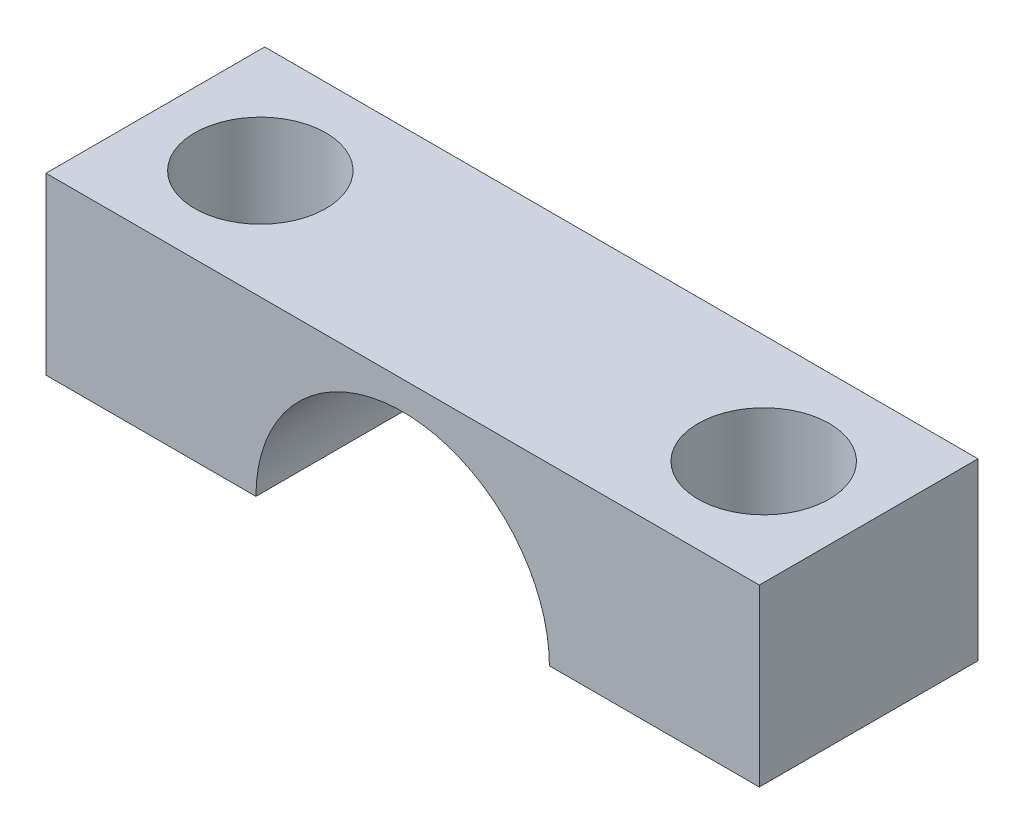
ISO-10303-21;
HEADER;
FILE_DESCRIPTION(('STEP AP214'),'2;1');
FILE_NAME('part.step','',(''),(''),'','','');
FILE_SCHEMA(('AUTOMOTIVE_DESIGN { 1 0 10303 214 1 1 1 1 }'));
ENDSEC;
DATA;
#1=APPLICATION_CONTEXT('core data for automotive mechanical design processes');
#2=APPLICATION_PROTOCOL_DEFINITION('international standard','automotive_design',2000,#1);
#3=PRODUCT_CONTEXT('',#1,'mechanical');
#4=PRODUCT('Part','Part','',(#3));
#5=PRODUCT_RELATED_PRODUCT_CATEGORY('part','',(#4));
#6=PRODUCT_DEFINITION_FORMATION('','',#4);
#7=PRODUCT_DEFINITION_CONTEXT('part definition',#1,'design');
#8=PRODUCT_DEFINITION('design','',#6,#7);
#9=PRODUCT_DEFINITION_SHAPE('','',#8);
#10=(LENGTH_UNIT() NAMED_UNIT(*) SI_UNIT(.MILLI.,.METRE.));
#11=(NAMED_UNIT(*) PLANE_ANGLE_UNIT() SI_UNIT($,.RADIAN.));
#12=(NAMED_UNIT(*) SI_UNIT($,.STERADIAN.) SOLID_ANGLE_UNIT());
#13=UNCERTAINTY_MEASURE_WITH_UNIT(LENGTH_MEASURE(1.E-05),#10,'distance_accuracy_value','');
#14=(GEOMETRIC_REPRESENTATION_CONTEXT(3) GLOBAL_UNCERTAINTY_ASSIGNED_CONTEXT((#13)) GLOBAL_UNIT_ASSIGNED_CONTEXT((#10,
#11,#12)) REPRESENTATION_CONTEXT('',''));
#15=CARTESIAN_POINT('',(0.,0.,0.));
#16=DIRECTION('',(0.,0.,1.));
#17=DIRECTION('',(1.,0.,0.));
#18=AXIS2_PLACEMENT_3D('',#15,#16,#17);
#19=CARTESIAN_POINT('',(-8.155,-2.,-5.));
#20=DIRECTION('',(0.,-1.,0.));
#21=DIRECTION('',(0.,0.,-1.));
#22=AXIS2_PLACEMENT_3D('',#19,#20,#21);
#23=PLANE('',#22);
#24=CARTESIAN_POINT('',(5.755,-2.,-2.5));
#25=DIRECTION('',(0.,-1.,0.));
#26=DIRECTION('',(0.,0.,-1.));
#27=AXIS2_PLACEMENT_3D('',#24,#25,#26);
#28=CIRCLE('',#27,1.5);
#29=CARTESIAN_POINT('',(5.755,-2.,-4.));
#30=VERTEX_POINT('',#29);
#31=EDGE_CURVE('E138',#30,#30,#28,.F.);
#32=ORIENTED_EDGE('',*,*,#31,.T.);
#33=EDGE_LOOP('',(#32));
#34=FACE_BOUND('',#33,.T.);
#35=DIRECTION('',(0.,0.,1.));
#36=VECTOR('',#35,1.);
#37=CARTESIAN_POINT('',(3.355,-2.,-5.));
#38=LINE('',#37,#36);
#39=CARTESIAN_POINT('',(3.355,-2.,-5.));
#40=VERTEX_POINT('',#39);
#41=CARTESIAN_POINT('',(3.355,-2.,0.));
#42=VERTEX_POINT('',#41);
#43=EDGE_CURVE('E55',#40,#42,#38,.T.);
#44=ORIENTED_EDGE('',*,*,#43,.F.);
#45=DIRECTION('',(1.,0.,0.));
#46=VECTOR('',#45,1.);
#47=CARTESIAN_POINT('',(-8.155,-2.,-5.));
#48=LINE('',#47,#46);
#49=CARTESIAN_POINT('',(8.155,-2.,-5.));
#50=VERTEX_POINT('',#49);
#51=EDGE_CURVE('E87',#40,#50,#48,.T.);
#52=ORIENTED_EDGE('',*,*,#51,.T.);
#53=DIRECTION('',(0.,0.,1.));
#54=VECTOR('',#53,1.);
#55=CARTESIAN_POINT('',(8.155,-2.,-5.));
#56=LINE('',#55,#54);
#57=CARTESIAN_POINT('',(8.155,-2.,0.));
#58=VERTEX_POINT('',#57);
#59=EDGE_CURVE('E121',#50,#58,#56,.T.);
#60=ORIENTED_EDGE('',*,*,#59,.T.);
#61=DIRECTION('',(1.,0.,0.));
#62=VECTOR('',#61,1.);
#63=CARTESIAN_POINT('',(-8.155,-2.,0.));
#64=LINE('',#63,#62);
#65=EDGE_CURVE('E125',#42,#58,#64,.T.);
#66=ORIENTED_EDGE('',*,*,#65,.F.);
#67=EDGE_LOOP('',(#44,#52,#60,#66));
#68=FACE_BOUND('',#67,.T.);
#69=ADVANCED_FACE('F38',(#34,#68),#23,.T.);
#70=CARTESIAN_POINT('',(-5.755,-2.,-2.5));
#71=DIRECTION('',(0.,-1.,0.));
#72=DIRECTION('',(0.,0.,-1.));
#73=AXIS2_PLACEMENT_3D('',#70,#71,#72);
#74=CIRCLE('',#73,1.5);
#75=CARTESIAN_POINT('',(-5.755,-2.,-4.));
#76=VERTEX_POINT('',#75);
#77=EDGE_CURVE('E146',#76,#76,#74,.F.);
#78=ORIENTED_EDGE('',*,*,#77,.T.);
#79=EDGE_LOOP('',(#78));
#80=FACE_BOUND('',#79,.T.);
#81=DIRECTION('',(0.,0.,1.));
#82=VECTOR('',#81,1.);
#83=CARTESIAN_POINT('',(-3.355,-2.,-5.));
#84=LINE('',#83,#82);
#85=CARTESIAN_POINT('',(-3.355,-2.,-5.));
#86=VERTEX_POINT('',#85);
#87=CARTESIAN_POINT('',(-3.355,-2.,0.));
#88=VERTEX_POINT('',#87);
#89=EDGE_CURVE('E97',#86,#88,#84,.T.);
#90=ORIENTED_EDGE('',*,*,#89,.T.);
#91=CARTESIAN_POINT('',(-8.155,-2.,0.));
#92=VERTEX_POINT('',#91);
#93=EDGE_CURVE('E122',#92,#88,#64,.T.);
#94=ORIENTED_EDGE('',*,*,#93,.F.);
#95=DIRECTION('',(0.,0.,1.));
#96=VECTOR('',#95,1.);
#97=CARTESIAN_POINT('',(-8.155,-2.,-5.));
#98=LINE('',#97,#96);
#99=CARTESIAN_POINT('',(-8.155,-2.,-5.));
#100=VERTEX_POINT('',#99);
#101=EDGE_CURVE('E11',#100,#92,#98,.T.);
#102=ORIENTED_EDGE('',*,*,#101,.F.);
#103=EDGE_CURVE('E107',#100,#86,#48,.T.);
#104=ORIENTED_EDGE('',*,*,#103,.T.);
#105=EDGE_LOOP('',(#90,#94,#102,#104));
#106=FACE_BOUND('',#105,.T.);
#107=ADVANCED_FACE('F40',(#80,#106),#23,.T.);
#108=CARTESIAN_POINT('',(-8.155,-2.,-5.));
#109=DIRECTION('',(1.,0.,0.));
#110=DIRECTION('',(0.,0.,-1.));
#111=AXIS2_PLACEMENT_3D('',#108,#109,#110);
#112=PLANE('',#111);
#113=DIRECTION('',(0.,1.,0.));
#114=VECTOR('',#113,1.);
#115=CARTESIAN_POINT('',(-8.155,-2.,0.));
#116=LINE('',#115,#114);
#117=CARTESIAN_POINT('',(-8.155,2.,0.));
#118=VERTEX_POINT('',#117);
#119=EDGE_CURVE('E115',#92,#118,#116,.T.);
#120=ORIENTED_EDGE('',*,*,#119,.T.);
#121=DIRECTION('',(0.,0.,1.));
#122=VECTOR('',#121,1.);
#123=CARTESIAN_POINT('',(-8.155,2.,-5.));
#124=LINE('',#123,#122);
#125=CARTESIAN_POINT('',(-8.155,2.,-5.));
#126=VERTEX_POINT('',#125);
#127=EDGE_CURVE('E47',#126,#118,#124,.T.);
#128=ORIENTED_EDGE('',*,*,#127,.F.);
#129=DIRECTION('',(0.,1.,0.));
#130=VECTOR('',#129,1.);
#131=CARTESIAN_POINT('',(-8.155,-2.,-5.));
#132=LINE('',#131,#130);
#133=EDGE_CURVE('E119',#100,#126,#132,.T.);
#134=ORIENTED_EDGE('',*,*,#133,.F.);
#135=ORIENTED_EDGE('',*,*,#101,.T.);
#136=EDGE_LOOP('',(#120,#128,#134,#135));
#137=FACE_BOUND('',#136,.T.);
#138=ADVANCED_FACE('F162',(#137),#112,.F.);
#139=CARTESIAN_POINT('',(-8.155,2.,-5.));
#140=DIRECTION('',(0.,-1.,0.));
#141=DIRECTION('',(0.,0.,-1.));
#142=AXIS2_PLACEMENT_3D('',#139,#140,#141);
#143=PLANE('',#142);
#144=CARTESIAN_POINT('',(-5.755,2.,-2.5));
#145=DIRECTION('',(0.,-1.,0.));
#146=DIRECTION('',(0.,0.,-1.));
#147=AXIS2_PLACEMENT_3D('',#144,#145,#146);
#148=CIRCLE('',#147,1.5);
#149=CARTESIAN_POINT('',(-5.755,2.,-4.));
#150=VERTEX_POINT('',#149);
#151=EDGE_CURVE('E42',#150,#150,#148,.F.);
#152=ORIENTED_EDGE('',*,*,#151,.F.);
#153=EDGE_LOOP('',(#152));
#154=FACE_BOUND('',#153,.T.);
#155=CARTESIAN_POINT('',(5.755,2.,-2.5));
#156=DIRECTION('',(0.,-1.,0.));
#157=DIRECTION('',(0.,0.,-1.));
#158=AXIS2_PLACEMENT_3D('',#155,#156,#157);
#159=CIRCLE('',#158,1.5);
#160=CARTESIAN_POINT('',(5.755,2.,-4.));
#161=VERTEX_POINT('',#160);
#162=EDGE_CURVE('E136',#161,#161,#159,.F.);
#163=ORIENTED_EDGE('',*,*,#162,.F.);
#164=EDGE_LOOP('',(#163));
#165=FACE_BOUND('',#164,.T.);
#166=DIRECTION('',(1.,0.,0.));
#167=VECTOR('',#166,1.);
#168=CARTESIAN_POINT('',(-8.155,2.,0.));
#169=LINE('',#168,#167);
#170=CARTESIAN_POINT('',(8.155,2.,0.));
#171=VERTEX_POINT('',#170);
#172=EDGE_CURVE('E128',#118,#171,#169,.T.);
#173=ORIENTED_EDGE('',*,*,#172,.T.);
#174=DIRECTION('',(0.,0.,1.));
#175=VECTOR('',#174,1.);
#176=CARTESIAN_POINT('',(8.155,2.,-5.));
#177=LINE('',#176,#175);
#178=CARTESIAN_POINT('',(8.155,2.,-5.));
#179=VERTEX_POINT('',#178);
#180=EDGE_CURVE('E134',#179,#171,#177,.T.);
#181=ORIENTED_EDGE('',*,*,#180,.F.);
#182=DIRECTION('',(1.,0.,0.));
#183=VECTOR('',#182,1.);
#184=CARTESIAN_POINT('',(-8.155,2.,-5.));
#185=LINE('',#184,#183);
#186=EDGE_CURVE('E113',#126,#179,#185,.T.);
#187=ORIENTED_EDGE('',*,*,#186,.F.);
#188=ORIENTED_EDGE('',*,*,#127,.T.);
#189=EDGE_LOOP('',(#173,#181,#187,#188));
#190=FACE_BOUND('',#189,.T.);
#191=ADVANCED_FACE('F160',(#154,#165,#190),#143,.F.);
#192=CARTESIAN_POINT('',(8.155,-2.,-5.));
#193=DIRECTION('',(1.,0.,0.));
#194=DIRECTION('',(0.,0.,-1.));
#195=AXIS2_PLACEMENT_3D('',#192,#193,#194);
#196=PLANE('',#195);
#197=DIRECTION('',(0.,1.,0.));
#198=VECTOR('',#197,1.);
#199=CARTESIAN_POINT('',(8.155,-2.,0.));
#200=LINE('',#199,#198);
#201=EDGE_CURVE('E124',#58,#171,#200,.T.);
#202=ORIENTED_EDGE('',*,*,#201,.F.);
#203=ORIENTED_EDGE('',*,*,#59,.F.);
#204=DIRECTION('',(0.,1.,0.));
#205=VECTOR('',#204,1.);
#206=CARTESIAN_POINT('',(8.155,-2.,-5.));
#207=LINE('',#206,#205);
#208=EDGE_CURVE('E110',#50,#179,#207,.T.);
#209=ORIENTED_EDGE('',*,*,#208,.T.);
#210=ORIENTED_EDGE('',*,*,#180,.T.);
#211=EDGE_LOOP('',(#202,#203,#209,#210));
#212=FACE_BOUND('',#211,.T.);
#213=ADVANCED_FACE('F156',(#212),#196,.T.);
#214=CARTESIAN_POINT('',(0.,0.,-5.));
#215=DIRECTION('',(0.,0.,1.));
#216=DIRECTION('',(1.,0.,0.));
#217=AXIS2_PLACEMENT_3D('',#214,#215,#216);
#218=PLANE('',#217);
#219=ORIENTED_EDGE('',*,*,#51,.F.);
#220=CARTESIAN_POINT('',(0.,-2.,-5.));
#221=DIRECTION('',(0.,0.,1.));
#222=DIRECTION('',(1.,0.,0.));
#223=AXIS2_PLACEMENT_3D('',#220,#221,#222);
#224=CIRCLE('',#223,3.355);
#225=EDGE_CURVE('E100',#40,#86,#224,.T.);
#226=ORIENTED_EDGE('',*,*,#225,.T.);
#227=ORIENTED_EDGE('',*,*,#103,.F.);
#228=ORIENTED_EDGE('',*,*,#133,.T.);
#229=ORIENTED_EDGE('',*,*,#186,.T.);
#230=ORIENTED_EDGE('',*,*,#208,.F.);
#231=EDGE_LOOP('',(#219,#226,#227,#228,#229,#230));
#232=FACE_BOUND('',#231,.T.);
#233=ADVANCED_FACE('F106',(#232),#218,.F.);
#234=CARTESIAN_POINT('',(0.,0.,0.));
#235=DIRECTION('',(0.,0.,1.));
#236=DIRECTION('',(1.,0.,0.));
#237=AXIS2_PLACEMENT_3D('',#234,#235,#236);
#238=PLANE('',#237);
#239=CARTESIAN_POINT('',(0.,-2.,0.));
#240=DIRECTION('',(0.,0.,1.));
#241=DIRECTION('',(1.,0.,0.));
#242=AXIS2_PLACEMENT_3D('',#239,#240,#241);
#243=CIRCLE('',#242,3.355);
#244=EDGE_CURVE('E101',#42,#88,#243,.T.);
#245=ORIENTED_EDGE('',*,*,#244,.F.);
#246=ORIENTED_EDGE('',*,*,#65,.T.);
#247=ORIENTED_EDGE('',*,*,#201,.T.);
#248=ORIENTED_EDGE('',*,*,#172,.F.);
#249=ORIENTED_EDGE('',*,*,#119,.F.);
#250=ORIENTED_EDGE('',*,*,#93,.T.);
#251=EDGE_LOOP('',(#245,#246,#247,#248,#249,#250));
#252=FACE_BOUND('',#251,.T.);
#253=ADVANCED_FACE('F152',(#252),#238,.T.);
#254=CARTESIAN_POINT('',(0.,-2.,-5.));
#255=DIRECTION('',(0.,0.,1.));
#256=DIRECTION('',(1.,0.,0.));
#257=AXIS2_PLACEMENT_3D('',#254,#255,#256);
#258=CYLINDRICAL_SURFACE('',#257,3.355);
#259=ORIENTED_EDGE('',*,*,#244,.T.);
#260=ORIENTED_EDGE('',*,*,#89,.F.);
#261=ORIENTED_EDGE('',*,*,#225,.F.);
#262=ORIENTED_EDGE('',*,*,#43,.T.);
#263=EDGE_LOOP('',(#259,#260,#261,#262));
#264=FACE_BOUND('',#263,.T.);
#265=ADVANCED_FACE('F99',(#264),#258,.F.);
#266=CARTESIAN_POINT('',(5.755,2.5,-2.5));
#267=DIRECTION('',(0.,-1.,0.));
#268=DIRECTION('',(0.,0.,-1.));
#269=AXIS2_PLACEMENT_3D('',#266,#267,#268);
#270=CYLINDRICAL_SURFACE('',#269,1.5);
#271=ORIENTED_EDGE('',*,*,#31,.F.);
#272=EDGE_LOOP('',(#271));
#273=FACE_BOUND('',#272,.T.);
#274=ORIENTED_EDGE('',*,*,#162,.T.);
#275=EDGE_LOOP('',(#274));
#276=FACE_BOUND('',#275,.T.);
#277=ADVANCED_FACE('F195',(#273,#276),#270,.F.);
#278=CARTESIAN_POINT('',(-5.755,2.5,-2.5));
#279=DIRECTION('',(0.,-1.,0.));
#280=DIRECTION('',(0.,0.,-1.));
#281=AXIS2_PLACEMENT_3D('',#278,#279,#280);
#282=CYLINDRICAL_SURFACE('',#281,1.5);
#283=ORIENTED_EDGE('',*,*,#77,.F.);
#284=EDGE_LOOP('',(#283));
#285=FACE_BOUND('',#284,.T.);
#286=ORIENTED_EDGE('',*,*,#151,.T.);
#287=EDGE_LOOP('',(#286));
#288=FACE_BOUND('',#287,.T.);
#289=ADVANCED_FACE('F200',(#285,#288),#282,.F.);
#290=CLOSED_SHELL('',(#69,#107,#138,#191,#213,#233,#253,#265,#277,#289));
#291=MANIFOLD_SOLID_BREP('B2',#290);
#292=ADVANCED_BREP_SHAPE_REPRESENTATION('',(#18,#291),#14);
#293=SHAPE_DEFINITION_REPRESENTATION(#9,#292);
ENDSEC;
END-ISO-10303-21;
